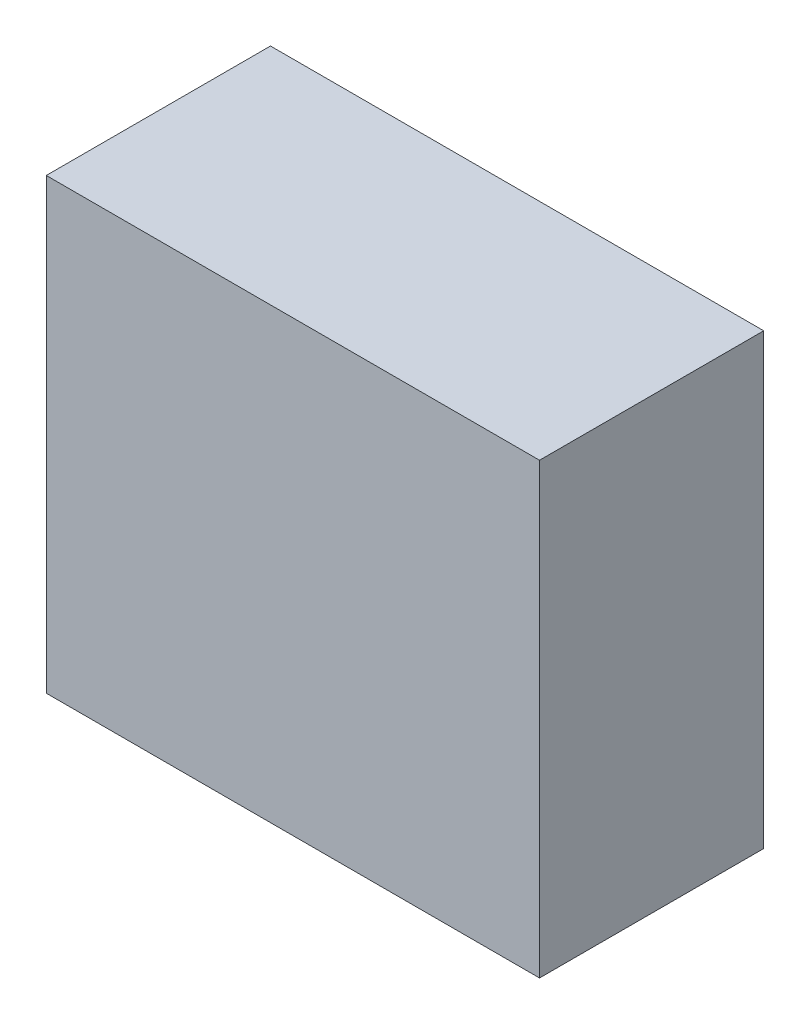
ISO-10303-21;
HEADER;
FILE_DESCRIPTION(('STEP AP214'),'2;1');
FILE_NAME('part.step','',(''),(''),'','','');
FILE_SCHEMA(('AUTOMOTIVE_DESIGN { 1 0 10303 214 1 1 1 1 }'));
ENDSEC;
DATA;
#1=APPLICATION_CONTEXT('core data for automotive mechanical design processes');
#2=APPLICATION_PROTOCOL_DEFINITION('international standard','automotive_design',2000,#1);
#3=PRODUCT_CONTEXT('',#1,'mechanical');
#4=PRODUCT('Part','Part','',(#3));
#5=PRODUCT_RELATED_PRODUCT_CATEGORY('part','',(#4));
#6=PRODUCT_DEFINITION_FORMATION('','',#4);
#7=PRODUCT_DEFINITION_CONTEXT('part definition',#1,'design');
#8=PRODUCT_DEFINITION('design','',#6,#7);
#9=PRODUCT_DEFINITION_SHAPE('','',#8);
#10=(LENGTH_UNIT() NAMED_UNIT(*) SI_UNIT(.MILLI.,.METRE.));
#11=(NAMED_UNIT(*) PLANE_ANGLE_UNIT() SI_UNIT($,.RADIAN.));
#12=(NAMED_UNIT(*) SI_UNIT($,.STERADIAN.) SOLID_ANGLE_UNIT());
#13=UNCERTAINTY_MEASURE_WITH_UNIT(LENGTH_MEASURE(1.E-05),#10,'distance_accuracy_value','');
#14=(GEOMETRIC_REPRESENTATION_CONTEXT(3) GLOBAL_UNCERTAINTY_ASSIGNED_CONTEXT((#13)) GLOBAL_UNIT_ASSIGNED_CONTEXT((#10,
#11,#12)) REPRESENTATION_CONTEXT('',''));
#15=CARTESIAN_POINT('',(0.,0.,0.));
#16=DIRECTION('',(0.,0.,1.));
#17=DIRECTION('',(1.,0.,0.));
#18=AXIS2_PLACEMENT_3D('',#15,#16,#17);
#19=CARTESIAN_POINT('',(0.55000144,-0.499999,0.499999));
#20=DIRECTION('',(0.,0.,1.));
#21=DIRECTION('',(1.,0.,0.));
#22=AXIS2_PLACEMENT_3D('',#19,#20,#21);
#23=PLANE('',#22);
#24=DIRECTION('',(0.,1.,0.));
#25=VECTOR('',#24,1.);
#26=CARTESIAN_POINT('',(-0.5499989,-0.499999,0.499999));
#27=LINE('',#26,#25);
#28=CARTESIAN_POINT('',(-0.5499989,-0.499999,0.499999));
#29=VERTEX_POINT('',#28);
#30=CARTESIAN_POINT('',(-0.5499989,0.50000154,0.499999));
#31=VERTEX_POINT('',#30);
#32=EDGE_CURVE('E53',#29,#31,#27,.T.);
#33=ORIENTED_EDGE('',*,*,#32,.F.);
#34=DIRECTION('',(1.,0.,0.));
#35=VECTOR('',#34,1.);
#36=CARTESIAN_POINT('',(0.55000144,-0.499999,0.499999));
#37=LINE('',#36,#35);
#38=CARTESIAN_POINT('',(0.55000144,-0.499999,0.499999));
#39=VERTEX_POINT('',#38);
#40=EDGE_CURVE('E68',#39,#29,#37,.F.);
#41=ORIENTED_EDGE('',*,*,#40,.F.);
#42=DIRECTION('',(0.,1.,0.));
#43=VECTOR('',#42,1.);
#44=CARTESIAN_POINT('',(0.55000144,0.50000154,0.499999));
#45=LINE('',#44,#43);
#46=CARTESIAN_POINT('',(0.55000144,0.50000154,0.499999));
#47=VERTEX_POINT('',#46);
#48=EDGE_CURVE('E20',#47,#39,#45,.F.);
#49=ORIENTED_EDGE('',*,*,#48,.F.);
#50=DIRECTION('',(1.,0.,0.));
#51=VECTOR('',#50,1.);
#52=CARTESIAN_POINT('',(-0.5499989,0.50000154,0.499999));
#53=LINE('',#52,#51);
#54=EDGE_CURVE('E58',#31,#47,#53,.T.);
#55=ORIENTED_EDGE('',*,*,#54,.F.);
#56=EDGE_LOOP('',(#33,#41,#49,#55));
#57=FACE_BOUND('',#56,.T.);
#58=ADVANCED_FACE('F17',(#57),#23,.T.);
#59=CARTESIAN_POINT('',(0.55000144,0.50000154,0.));
#60=DIRECTION('',(1.,0.,0.));
#61=DIRECTION('',(0.,0.,-1.));
#62=AXIS2_PLACEMENT_3D('',#59,#60,#61);
#63=PLANE('',#62);
#64=DIRECTION('',(0.,0.,-1.));
#65=VECTOR('',#64,1.);
#66=CARTESIAN_POINT('',(0.55000144,-0.499999,0.));
#67=LINE('',#66,#65);
#68=CARTESIAN_POINT('',(0.55000144,-0.499999,0.));
#69=VERTEX_POINT('',#68);
#70=EDGE_CURVE('E79',#69,#39,#67,.F.);
#71=ORIENTED_EDGE('',*,*,#70,.F.);
#72=DIRECTION('',(0.,1.,0.));
#73=VECTOR('',#72,1.);
#74=CARTESIAN_POINT('',(0.55000144,-0.499999,0.));
#75=LINE('',#74,#73);
#76=CARTESIAN_POINT('',(0.55000144,0.50000154,0.));
#77=VERTEX_POINT('',#76);
#78=EDGE_CURVE('E74',#69,#77,#75,.T.);
#79=ORIENTED_EDGE('',*,*,#78,.T.);
#80=DIRECTION('',(0.,0.,1.));
#81=VECTOR('',#80,1.);
#82=CARTESIAN_POINT('',(0.55000144,0.50000154,0.));
#83=LINE('',#82,#81);
#84=EDGE_CURVE('E63',#47,#77,#83,.F.);
#85=ORIENTED_EDGE('',*,*,#84,.F.);
#86=ORIENTED_EDGE('',*,*,#48,.T.);
#87=EDGE_LOOP('',(#71,#79,#85,#86));
#88=FACE_BOUND('',#87,.T.);
#89=ADVANCED_FACE('F73',(#88),#63,.T.);
#90=CARTESIAN_POINT('',(-0.5499989,0.50000154,0.));
#91=DIRECTION('',(0.,1.,0.));
#92=DIRECTION('',(0.,0.,1.));
#93=AXIS2_PLACEMENT_3D('',#90,#91,#92);
#94=PLANE('',#93);
#95=ORIENTED_EDGE('',*,*,#84,.T.);
#96=DIRECTION('',(1.,0.,0.));
#97=VECTOR('',#96,1.);
#98=CARTESIAN_POINT('',(0.55000144,0.50000154,0.));
#99=LINE('',#98,#97);
#100=CARTESIAN_POINT('',(-0.5499989,0.50000154,0.));
#101=VERTEX_POINT('',#100);
#102=EDGE_CURVE('E84',#77,#101,#99,.F.);
#103=ORIENTED_EDGE('',*,*,#102,.T.);
#104=DIRECTION('',(0.,0.,1.));
#105=VECTOR('',#104,1.);
#106=CARTESIAN_POINT('',(-0.5499989,0.50000154,0.));
#107=LINE('',#106,#105);
#108=EDGE_CURVE('E65',#31,#101,#107,.F.);
#109=ORIENTED_EDGE('',*,*,#108,.F.);
#110=ORIENTED_EDGE('',*,*,#54,.T.);
#111=EDGE_LOOP('',(#95,#103,#109,#110));
#112=FACE_BOUND('',#111,.T.);
#113=ADVANCED_FACE('F60',(#112),#94,.T.);
#114=CARTESIAN_POINT('',(-0.5499989,-0.499999,0.));
#115=DIRECTION('',(-1.,0.,0.));
#116=DIRECTION('',(0.,0.,1.));
#117=AXIS2_PLACEMENT_3D('',#114,#115,#116);
#118=PLANE('',#117);
#119=ORIENTED_EDGE('',*,*,#108,.T.);
#120=DIRECTION('',(0.,1.,0.));
#121=VECTOR('',#120,1.);
#122=CARTESIAN_POINT('',(-0.5499989,-0.499999,0.));
#123=LINE('',#122,#121);
#124=CARTESIAN_POINT('',(-0.5499989,-0.499999,0.));
#125=VERTEX_POINT('',#124);
#126=EDGE_CURVE('E26',#101,#125,#123,.F.);
#127=ORIENTED_EDGE('',*,*,#126,.T.);
#128=DIRECTION('',(0.,0.,-1.));
#129=VECTOR('',#128,1.);
#130=CARTESIAN_POINT('',(-0.5499989,-0.499999,0.));
#131=LINE('',#130,#129);
#132=EDGE_CURVE('E34',#29,#125,#131,.T.);
#133=ORIENTED_EDGE('',*,*,#132,.F.);
#134=ORIENTED_EDGE('',*,*,#32,.T.);
#135=EDGE_LOOP('',(#119,#127,#133,#134));
#136=FACE_BOUND('',#135,.T.);
#137=ADVANCED_FACE('F88',(#136),#118,.T.);
#138=CARTESIAN_POINT('',(0.55000144,-0.499999,0.));
#139=DIRECTION('',(0.,-1.,0.));
#140=DIRECTION('',(0.,0.,-1.));
#141=AXIS2_PLACEMENT_3D('',#138,#139,#140);
#142=PLANE('',#141);
#143=ORIENTED_EDGE('',*,*,#132,.T.);
#144=DIRECTION('',(1.,0.,0.));
#145=VECTOR('',#144,1.);
#146=CARTESIAN_POINT('',(0.55000144,-0.499999,0.));
#147=LINE('',#146,#145);
#148=EDGE_CURVE('E11',#125,#69,#147,.T.);
#149=ORIENTED_EDGE('',*,*,#148,.T.);
#150=ORIENTED_EDGE('',*,*,#70,.T.);
#151=ORIENTED_EDGE('',*,*,#40,.T.);
#152=EDGE_LOOP('',(#143,#149,#150,#151));
#153=FACE_BOUND('',#152,.T.);
#154=ADVANCED_FACE('F91',(#153),#142,.T.);
#155=CARTESIAN_POINT('',(0.55000144,-0.499999,0.));
#156=DIRECTION('',(0.,0.,1.));
#157=DIRECTION('',(1.,0.,0.));
#158=AXIS2_PLACEMENT_3D('',#155,#156,#157);
#159=PLANE('',#158);
#160=ORIENTED_EDGE('',*,*,#126,.F.);
#161=ORIENTED_EDGE('',*,*,#102,.F.);
#162=ORIENTED_EDGE('',*,*,#78,.F.);
#163=ORIENTED_EDGE('',*,*,#148,.F.);
#164=EDGE_LOOP('',(#160,#161,#162,#163));
#165=FACE_BOUND('',#164,.T.);
#166=ADVANCED_FACE('F90',(#165),#159,.F.);
#167=CLOSED_SHELL('',(#58,#89,#113,#137,#154,#166));
#168=MANIFOLD_SOLID_BREP('B1',#167);
#169=ADVANCED_BREP_SHAPE_REPRESENTATION('',(#18,#168),#14);
#170=SHAPE_DEFINITION_REPRESENTATION(#9,#169);
ENDSEC;
END-ISO-10303-21;
